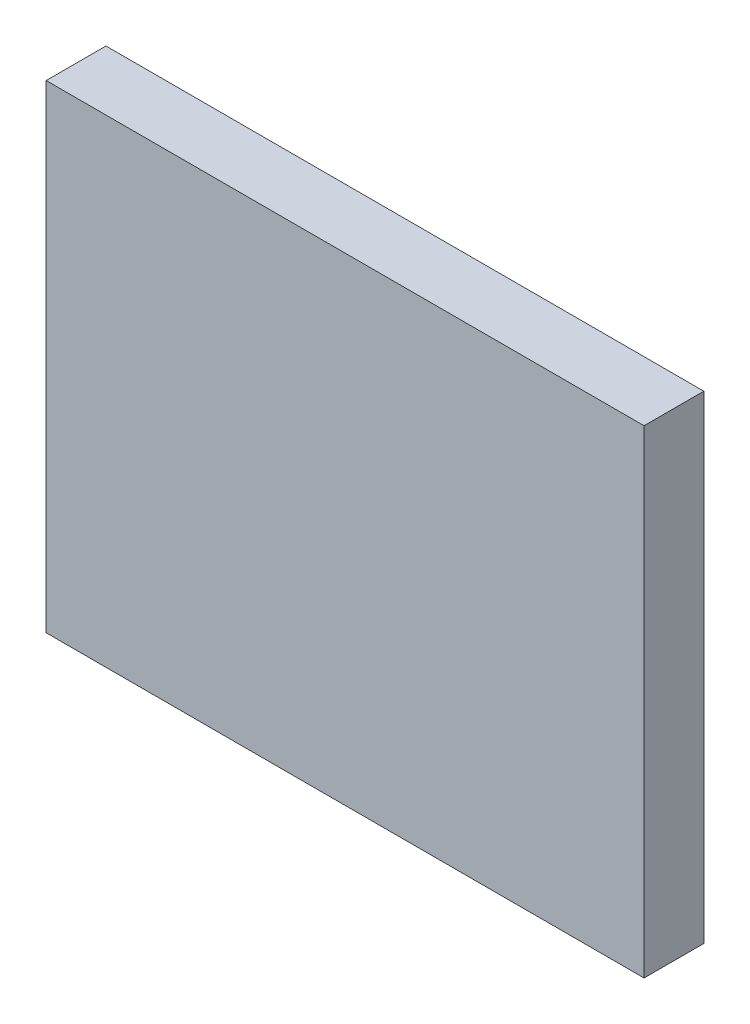
ISO-10303-21;
HEADER;
FILE_DESCRIPTION(('STEP AP214'),'2;1');
FILE_NAME('part.step','',(''),(''),'','','');
FILE_SCHEMA(('AUTOMOTIVE_DESIGN { 1 0 10303 214 1 1 1 1 }'));
ENDSEC;
DATA;
#1=APPLICATION_CONTEXT('core data for automotive mechanical design processes');
#2=APPLICATION_PROTOCOL_DEFINITION('international standard','automotive_design',2000,#1);
#3=PRODUCT_CONTEXT('',#1,'mechanical');
#4=PRODUCT('Part','Part','',(#3));
#5=PRODUCT_RELATED_PRODUCT_CATEGORY('part','',(#4));
#6=PRODUCT_DEFINITION_FORMATION('','',#4);
#7=PRODUCT_DEFINITION_CONTEXT('part definition',#1,'design');
#8=PRODUCT_DEFINITION('design','',#6,#7);
#9=PRODUCT_DEFINITION_SHAPE('','',#8);
#10=(LENGTH_UNIT() NAMED_UNIT(*) SI_UNIT(.MILLI.,.METRE.));
#11=(NAMED_UNIT(*) PLANE_ANGLE_UNIT() SI_UNIT($,.RADIAN.));
#12=(NAMED_UNIT(*) SI_UNIT($,.STERADIAN.) SOLID_ANGLE_UNIT());
#13=UNCERTAINTY_MEASURE_WITH_UNIT(LENGTH_MEASURE(1.E-05),#10,'distance_accuracy_value','');
#14=(GEOMETRIC_REPRESENTATION_CONTEXT(3) GLOBAL_UNCERTAINTY_ASSIGNED_CONTEXT((#13)) GLOBAL_UNIT_ASSIGNED_CONTEXT((#10,
#11,#12)) REPRESENTATION_CONTEXT('',''));
#15=CARTESIAN_POINT('',(0.,0.,0.));
#16=DIRECTION('',(0.,0.,1.));
#17=DIRECTION('',(1.,0.,0.));
#18=AXIS2_PLACEMENT_3D('',#15,#16,#17);
#19=CARTESIAN_POINT('',(-3.04,-2.35,0.));
#20=DIRECTION('',(1.,0.,0.));
#21=DIRECTION('',(0.,0.,1.));
#22=AXIS2_PLACEMENT_3D('',#19,#20,#21);
#23=PLANE('',#22);
#24=DIRECTION('',(0.,1.,0.));
#25=VECTOR('',#24,1.);
#26=CARTESIAN_POINT('',(-3.04,-2.35,0.1));
#27=LINE('',#26,#25);
#28=CARTESIAN_POINT('',(-3.04,-2.35,0.1));
#29=VERTEX_POINT('',#28);
#30=CARTESIAN_POINT('',(-3.04,-1.55,0.1));
#31=VERTEX_POINT('',#30);
#32=EDGE_CURVE('E11',#29,#31,#27,.T.);
#33=ORIENTED_EDGE('',*,*,#32,.T.);
#34=DIRECTION('',(0.,0.,1.));
#35=VECTOR('',#34,1.);
#36=CARTESIAN_POINT('',(-3.04,-1.55,0.));
#37=LINE('',#36,#35);
#38=CARTESIAN_POINT('',(-3.04,-1.55,0.));
#39=VERTEX_POINT('',#38);
#40=EDGE_CURVE('E24',#39,#31,#37,.T.);
#41=ORIENTED_EDGE('',*,*,#40,.F.);
#42=DIRECTION('',(0.,1.,0.));
#43=VECTOR('',#42,1.);
#44=CARTESIAN_POINT('',(-3.04,-2.35,0.));
#45=LINE('',#44,#43);
#46=CARTESIAN_POINT('',(-3.04,-2.35,0.));
#47=VERTEX_POINT('',#46);
#48=EDGE_CURVE('E86',#47,#39,#45,.T.);
#49=ORIENTED_EDGE('',*,*,#48,.F.);
#50=DIRECTION('',(0.,0.,1.));
#51=VECTOR('',#50,1.);
#52=CARTESIAN_POINT('',(-3.04,-2.35,0.));
#53=LINE('',#52,#51);
#54=EDGE_CURVE('E36',#47,#29,#53,.T.);
#55=ORIENTED_EDGE('',*,*,#54,.T.);
#56=EDGE_LOOP('',(#33,#41,#49,#55));
#57=FACE_BOUND('',#56,.T.);
#58=ADVANCED_FACE('F17',(#57),#23,.F.);
#59=CARTESIAN_POINT('',(-2.04,-2.35,0.));
#60=DIRECTION('',(1.,0.,0.));
#61=DIRECTION('',(0.,0.,1.));
#62=AXIS2_PLACEMENT_3D('',#59,#60,#61);
#63=PLANE('',#62);
#64=DIRECTION('',(0.,0.,1.));
#65=VECTOR('',#64,1.);
#66=CARTESIAN_POINT('',(-2.04,-2.35,0.));
#67=LINE('',#66,#65);
#68=CARTESIAN_POINT('',(-2.04,-2.35,0.));
#69=VERTEX_POINT('',#68);
#70=CARTESIAN_POINT('',(-2.04,-2.35,0.1));
#71=VERTEX_POINT('',#70);
#72=EDGE_CURVE('E83',#69,#71,#67,.T.);
#73=ORIENTED_EDGE('',*,*,#72,.F.);
#74=DIRECTION('',(0.,1.,0.));
#75=VECTOR('',#74,1.);
#76=CARTESIAN_POINT('',(-2.04,-2.35,0.));
#77=LINE('',#76,#75);
#78=CARTESIAN_POINT('',(-2.04,-1.55,0.));
#79=VERTEX_POINT('',#78);
#80=EDGE_CURVE('E63',#69,#79,#77,.T.);
#81=ORIENTED_EDGE('',*,*,#80,.T.);
#82=DIRECTION('',(0.,0.,1.));
#83=VECTOR('',#82,1.);
#84=CARTESIAN_POINT('',(-2.04,-1.55,0.));
#85=LINE('',#84,#83);
#86=CARTESIAN_POINT('',(-2.04,-1.55,0.1));
#87=VERTEX_POINT('',#86);
#88=EDGE_CURVE('E57',#79,#87,#85,.T.);
#89=ORIENTED_EDGE('',*,*,#88,.T.);
#90=DIRECTION('',(0.,1.,0.));
#91=VECTOR('',#90,1.);
#92=CARTESIAN_POINT('',(-2.04,-2.35,0.1));
#93=LINE('',#92,#91);
#94=EDGE_CURVE('E60',#71,#87,#93,.T.);
#95=ORIENTED_EDGE('',*,*,#94,.F.);
#96=EDGE_LOOP('',(#73,#81,#89,#95));
#97=FACE_BOUND('',#96,.T.);
#98=ADVANCED_FACE('F59',(#97),#63,.T.);
#99=CARTESIAN_POINT('',(-3.04,-2.35,0.));
#100=DIRECTION('',(0.,1.,0.));
#101=DIRECTION('',(0.,0.,1.));
#102=AXIS2_PLACEMENT_3D('',#99,#100,#101);
#103=PLANE('',#102);
#104=ORIENTED_EDGE('',*,*,#72,.T.);
#105=DIRECTION('',(1.,0.,0.));
#106=VECTOR('',#105,1.);
#107=CARTESIAN_POINT('',(-3.04,-2.35,0.1));
#108=LINE('',#107,#106);
#109=EDGE_CURVE('E71',#29,#71,#108,.T.);
#110=ORIENTED_EDGE('',*,*,#109,.F.);
#111=ORIENTED_EDGE('',*,*,#54,.F.);
#112=DIRECTION('',(1.,0.,0.));
#113=VECTOR('',#112,1.);
#114=CARTESIAN_POINT('',(-3.04,-2.35,0.));
#115=LINE('',#114,#113);
#116=EDGE_CURVE('E76',#47,#69,#115,.T.);
#117=ORIENTED_EDGE('',*,*,#116,.T.);
#118=EDGE_LOOP('',(#104,#110,#111,#117));
#119=FACE_BOUND('',#118,.T.);
#120=ADVANCED_FACE('F91',(#119),#103,.F.);
#121=CARTESIAN_POINT('',(-3.04,-1.55,0.));
#122=DIRECTION('',(0.,1.,0.));
#123=DIRECTION('',(0.,0.,1.));
#124=AXIS2_PLACEMENT_3D('',#121,#122,#123);
#125=PLANE('',#124);
#126=DIRECTION('',(1.,0.,0.));
#127=VECTOR('',#126,1.);
#128=CARTESIAN_POINT('',(-3.04,-1.55,0.));
#129=LINE('',#128,#127);
#130=EDGE_CURVE('E74',#39,#79,#129,.T.);
#131=ORIENTED_EDGE('',*,*,#130,.F.);
#132=ORIENTED_EDGE('',*,*,#40,.T.);
#133=DIRECTION('',(1.,0.,0.));
#134=VECTOR('',#133,1.);
#135=CARTESIAN_POINT('',(-3.04,-1.55,0.1));
#136=LINE('',#135,#134);
#137=EDGE_CURVE('E69',#31,#87,#136,.T.);
#138=ORIENTED_EDGE('',*,*,#137,.T.);
#139=ORIENTED_EDGE('',*,*,#88,.F.);
#140=EDGE_LOOP('',(#131,#132,#138,#139));
#141=FACE_BOUND('',#140,.T.);
#142=ADVANCED_FACE('F73',(#141),#125,.T.);
#143=CARTESIAN_POINT('',(-3.04,-2.35,0.));
#144=DIRECTION('',(0.,0.,1.));
#145=DIRECTION('',(1.,0.,0.));
#146=AXIS2_PLACEMENT_3D('',#143,#144,#145);
#147=PLANE('',#146);
#148=ORIENTED_EDGE('',*,*,#130,.T.);
#149=ORIENTED_EDGE('',*,*,#80,.F.);
#150=ORIENTED_EDGE('',*,*,#116,.F.);
#151=ORIENTED_EDGE('',*,*,#48,.T.);
#152=EDGE_LOOP('',(#148,#149,#150,#151));
#153=FACE_BOUND('',#152,.T.);
#154=ADVANCED_FACE('F89',(#153),#147,.F.);
#155=CARTESIAN_POINT('',(-3.04,-2.35,0.1));
#156=DIRECTION('',(0.,0.,1.));
#157=DIRECTION('',(1.,0.,0.));
#158=AXIS2_PLACEMENT_3D('',#155,#156,#157);
#159=PLANE('',#158);
#160=ORIENTED_EDGE('',*,*,#32,.F.);
#161=ORIENTED_EDGE('',*,*,#109,.T.);
#162=ORIENTED_EDGE('',*,*,#94,.T.);
#163=ORIENTED_EDGE('',*,*,#137,.F.);
#164=EDGE_LOOP('',(#160,#161,#162,#163));
#165=FACE_BOUND('',#164,.T.);
#166=ADVANCED_FACE('F68',(#165),#159,.T.);
#167=CLOSED_SHELL('',(#58,#98,#120,#142,#154,#166));
#168=MANIFOLD_SOLID_BREP('B1',#167);
#169=ADVANCED_BREP_SHAPE_REPRESENTATION('',(#18,#168),#14);
#170=SHAPE_DEFINITION_REPRESENTATION(#9,#169);
ENDSEC;
END-ISO-10303-21;
